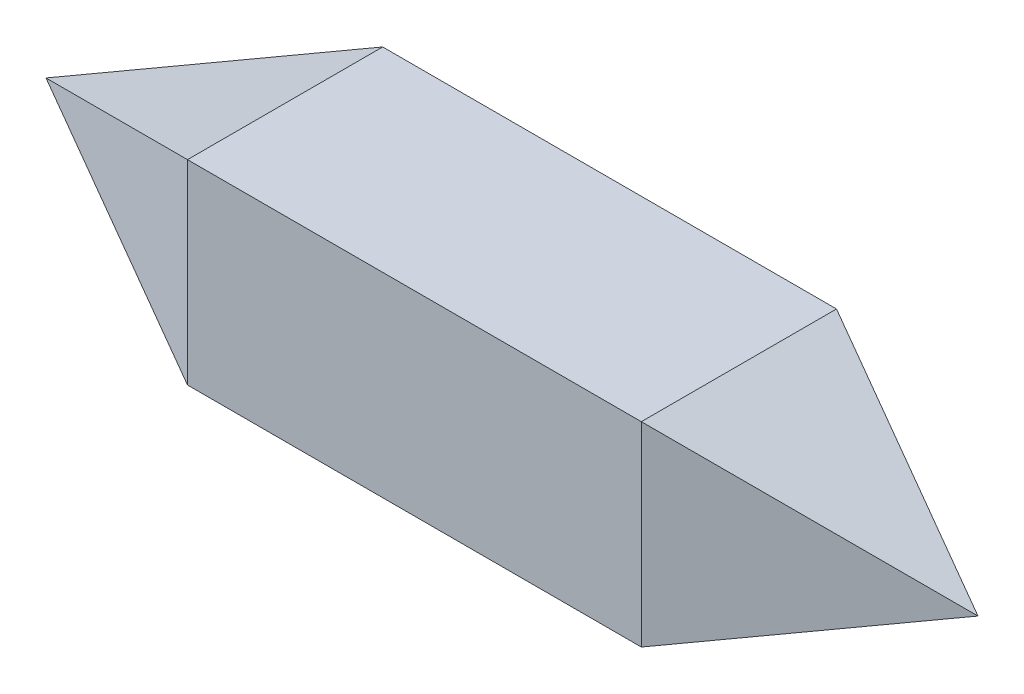
ISO-10303-21;
HEADER;
FILE_DESCRIPTION(('STEP AP214'),'2;1');
FILE_NAME('part.step','',(''),(''),'','','');
FILE_SCHEMA(('AUTOMOTIVE_DESIGN { 1 0 10303 214 1 1 1 1 }'));
ENDSEC;
DATA;
#1=APPLICATION_CONTEXT('core data for automotive mechanical design processes');
#2=APPLICATION_PROTOCOL_DEFINITION('international standard','automotive_design',2000,#1);
#3=PRODUCT_CONTEXT('',#1,'mechanical');
#4=PRODUCT('Part','Part','',(#3));
#5=PRODUCT_RELATED_PRODUCT_CATEGORY('part','',(#4));
#6=PRODUCT_DEFINITION_FORMATION('','',#4);
#7=PRODUCT_DEFINITION_CONTEXT('part definition',#1,'design');
#8=PRODUCT_DEFINITION('design','',#6,#7);
#9=PRODUCT_DEFINITION_SHAPE('','',#8);
#10=(LENGTH_UNIT() NAMED_UNIT(*) SI_UNIT(.MILLI.,.METRE.));
#11=(NAMED_UNIT(*) PLANE_ANGLE_UNIT() SI_UNIT($,.RADIAN.));
#12=(NAMED_UNIT(*) SI_UNIT($,.STERADIAN.) SOLID_ANGLE_UNIT());
#13=UNCERTAINTY_MEASURE_WITH_UNIT(LENGTH_MEASURE(1.E-05),#10,'distance_accuracy_value','');
#14=(GEOMETRIC_REPRESENTATION_CONTEXT(3) GLOBAL_UNCERTAINTY_ASSIGNED_CONTEXT((#13)) GLOBAL_UNIT_ASSIGNED_CONTEXT((#10,
#11,#12)) REPRESENTATION_CONTEXT('',''));
#15=CARTESIAN_POINT('',(0.,0.,0.));
#16=DIRECTION('',(0.,0.,1.));
#17=DIRECTION('',(1.,0.,0.));
#18=AXIS2_PLACEMENT_3D('',#15,#16,#17);
#19=CARTESIAN_POINT('',(0.,430.1,-2.5806));
#20=DIRECTION('',(-0.377937741687455,0.925831012338746,0.));
#21=DIRECTION('',(-0.925831012338746,-0.377937741687455,0.));
#22=AXIS2_PLACEMENT_3D('',#19,#20,#21);
#23=PLANE('',#22);
#24=DIRECTION('',(0.866043267642828,0.353531510985258,-0.353531511058086));
#25=VECTOR('',#24,1.);
#26=CARTESIAN_POINT('',(-526.806235776382,215.050000096685,215.049999840951));
#27=LINE('',#26,#25);
#28=CARTESIAN_POINT('',(-526.806236089617,215.049999937635,215.05));
#29=VERTEX_POINT('',#28);
#30=CARTESIAN_POINT('',(6.53239407011341E-08,430.099999933335,-1.33331054530395E-08));
#31=VERTEX_POINT('',#30);
#32=EDGE_CURVE('E87',#29,#31,#27,.T.);
#33=ORIENTED_EDGE('',*,*,#32,.F.);
#34=DIRECTION('',(-0.866043267642828,-0.353531510985259,-0.353531511058086));
#35=VECTOR('',#34,1.);
#36=CARTESIAN_POINT('',(0.,430.099999893335,430.1));
#37=LINE('',#36,#35);
#38=CARTESIAN_POINT('',(6.53237257074457E-08,430.099999933335,430.100000013333));
#39=VERTEX_POINT('',#38);
#40=EDGE_CURVE('E21',#39,#29,#37,.T.);
#41=ORIENTED_EDGE('',*,*,#40,.F.);
#42=DIRECTION('',(0.,0.,-1.));
#43=VECTOR('',#42,1.);
#44=CARTESIAN_POINT('',(0.,430.1,215.05));
#45=LINE('',#44,#43);
#46=EDGE_CURVE('E63',#39,#31,#45,.T.);
#47=ORIENTED_EDGE('',*,*,#46,.T.);
#48=EDGE_LOOP('',(#33,#41,#47));
#49=FACE_BOUND('',#48,.T.);
#50=ADVANCED_FACE('F17',(#49),#23,.T.);
#51=CARTESIAN_POINT('',(1529.967073583,213.7597,-2.5806));
#52=DIRECTION('',(0.377937741687454,0.925831012338746,0.));
#53=DIRECTION('',(-0.925831012338746,0.377937741687454,0.));
#54=AXIS2_PLACEMENT_3D('',#51,#52,#53);
#55=PLANE('',#54);
#56=DIRECTION('',(-0.866043267642828,0.353531510985258,0.353531511058086));
#57=VECTOR('',#56,1.);
#58=CARTESIAN_POINT('',(1526.80623577638,215.050000096685,215.050000159049));
#59=LINE('',#58,#57);
#60=CARTESIAN_POINT('',(1526.80623608962,215.049999937636,215.05));
#61=VERTEX_POINT('',#60);
#62=CARTESIAN_POINT('',(999.999999934676,430.099999933335,430.100000013333));
#63=VERTEX_POINT('',#62);
#64=EDGE_CURVE('E77',#61,#63,#59,.T.);
#65=ORIENTED_EDGE('',*,*,#64,.F.);
#66=DIRECTION('',(0.866043267642828,-0.353531510985258,0.353531511058086));
#67=VECTOR('',#66,1.);
#68=CARTESIAN_POINT('',(1000.,430.099999893335,0.));
#69=LINE('',#68,#67);
#70=CARTESIAN_POINT('',(999.999999934676,430.099999933335,-1.33330634956454E-08));
#71=VERTEX_POINT('',#70);
#72=EDGE_CURVE('E85',#71,#61,#69,.T.);
#73=ORIENTED_EDGE('',*,*,#72,.F.);
#74=DIRECTION('',(0.,0.,1.));
#75=VECTOR('',#74,1.);
#76=CARTESIAN_POINT('',(1000.,430.1,215.05));
#77=LINE('',#76,#75);
#78=EDGE_CURVE('E91',#71,#63,#77,.T.);
#79=ORIENTED_EDGE('',*,*,#78,.T.);
#80=EDGE_LOOP('',(#65,#73,#79));
#81=FACE_BOUND('',#80,.T.);
#82=ADVANCED_FACE('F114',(#81),#55,.T.);
#83=CARTESIAN_POINT('',(-529.967073583,-2.5806,213.7597));
#84=DIRECTION('',(-0.377937741687455,0.,0.925831012338746));
#85=DIRECTION('',(0.925831012338746,0.,0.377937741687455));
#86=AXIS2_PLACEMENT_3D('',#83,#84,#85);
#87=PLANE('',#86);
#88=ORIENTED_EDGE('',*,*,#40,.T.);
#89=DIRECTION('',(-0.866043267642828,0.353531511058086,-0.353531510985258));
#90=VECTOR('',#89,1.);
#91=CARTESIAN_POINT('',(0.,0.,430.099999893335));
#92=LINE('',#91,#90);
#93=CARTESIAN_POINT('',(6.53240118984413E-08,-1.33331054179135E-08,430.099999933335));
#94=VERTEX_POINT('',#93);
#95=EDGE_CURVE('E72',#94,#29,#92,.T.);
#96=ORIENTED_EDGE('',*,*,#95,.F.);
#97=DIRECTION('',(0.,1.,0.));
#98=VECTOR('',#97,1.);
#99=CARTESIAN_POINT('',(0.,215.05,430.1));
#100=LINE('',#99,#98);
#101=EDGE_CURVE('E74',#94,#39,#100,.T.);
#102=ORIENTED_EDGE('',*,*,#101,.T.);
#103=EDGE_LOOP('',(#88,#96,#102));
#104=FACE_BOUND('',#103,.T.);
#105=ADVANCED_FACE('F71',(#104),#87,.T.);
#106=CARTESIAN_POINT('',(1000.,-2.5806,430.1));
#107=DIRECTION('',(0.377937741687454,0.,0.925831012338746));
#108=DIRECTION('',(0.925831012338746,0.,-0.377937741687454));
#109=AXIS2_PLACEMENT_3D('',#106,#107,#108);
#110=PLANE('',#109);
#111=DIRECTION('',(-0.866043267642828,-0.353531511058086,0.353531510985258));
#112=VECTOR('',#111,1.);
#113=CARTESIAN_POINT('',(1526.80623582791,215.049999861984,215.050000075652));
#114=LINE('',#113,#112);
#115=CARTESIAN_POINT('',(999.999999934676,-1.33330915752516E-08,430.099999933335));
#116=VERTEX_POINT('',#115);
#117=EDGE_CURVE('E111',#61,#116,#114,.T.);
#118=ORIENTED_EDGE('',*,*,#117,.F.);
#119=ORIENTED_EDGE('',*,*,#64,.T.);
#120=DIRECTION('',(0.,-1.,0.));
#121=VECTOR('',#120,1.);
#122=CARTESIAN_POINT('',(1000.,215.05,430.1));
#123=LINE('',#122,#121);
#124=EDGE_CURVE('E97',#63,#116,#123,.T.);
#125=ORIENTED_EDGE('',*,*,#124,.T.);
#126=EDGE_LOOP('',(#118,#119,#125));
#127=FACE_BOUND('',#126,.T.);
#128=ADVANCED_FACE('F108',(#127),#110,.T.);
#129=CARTESIAN_POINT('',(0.,-2.5806,0.));
#130=DIRECTION('',(-0.377937741687454,0.,-0.925831012338746));
#131=DIRECTION('',(-0.925831012338746,0.,0.377937741687454));
#132=AXIS2_PLACEMENT_3D('',#129,#130,#131);
#133=PLANE('',#132);
#134=DIRECTION('',(0.866043267642828,-0.353531511058086,-0.353531510985258));
#135=VECTOR('',#134,1.);
#136=CARTESIAN_POINT('',(-526.806235827907,215.049999861984,215.049999924349));
#137=LINE('',#136,#135);
#138=CARTESIAN_POINT('',(6.53239407011341E-08,-1.33330985141455E-08,6.66654925707277E-08));
#139=VERTEX_POINT('',#138);
#140=EDGE_CURVE('E82',#29,#139,#137,.T.);
#141=ORIENTED_EDGE('',*,*,#140,.F.);
#142=ORIENTED_EDGE('',*,*,#32,.T.);
#143=DIRECTION('',(0.,1.,0.));
#144=VECTOR('',#143,1.);
#145=CARTESIAN_POINT('',(0.,215.05,0.));
#146=LINE('',#145,#144);
#147=EDGE_CURVE('E94',#139,#31,#146,.T.);
#148=ORIENTED_EDGE('',*,*,#147,.F.);
#149=EDGE_LOOP('',(#141,#142,#148));
#150=FACE_BOUND('',#149,.T.);
#151=ADVANCED_FACE('F93',(#150),#133,.T.);
#152=CARTESIAN_POINT('',(0.,430.1,430.1));
#153=DIRECTION('',(0.,-1.,0.));
#154=DIRECTION('',(0.,0.,-1.));
#155=AXIS2_PLACEMENT_3D('',#152,#153,#154);
#156=PLANE('',#155);
#157=ORIENTED_EDGE('',*,*,#46,.F.);
#158=DIRECTION('',(1.,0.,0.));
#159=VECTOR('',#158,1.);
#160=CARTESIAN_POINT('',(500.,430.1,430.1));
#161=LINE('',#160,#159);
#162=EDGE_CURVE('E95',#39,#63,#161,.T.);
#163=ORIENTED_EDGE('',*,*,#162,.T.);
#164=ORIENTED_EDGE('',*,*,#78,.F.);
#165=DIRECTION('',(1.,0.,0.));
#166=VECTOR('',#165,1.);
#167=CARTESIAN_POINT('',(500.,430.1,0.));
#168=LINE('',#167,#166);
#169=EDGE_CURVE('E147',#31,#71,#168,.T.);
#170=ORIENTED_EDGE('',*,*,#169,.F.);
#171=EDGE_LOOP('',(#157,#163,#164,#170));
#172=FACE_BOUND('',#171,.T.);
#173=ADVANCED_FACE('F121',(#172),#156,.F.);
#174=CARTESIAN_POINT('',(1529.967073583,-2.5806,216.3403));
#175=DIRECTION('',(0.377937741687454,0.,-0.925831012338746));
#176=DIRECTION('',(-0.925831012338746,0.,-0.377937741687454));
#177=AXIS2_PLACEMENT_3D('',#174,#175,#176);
#178=PLANE('',#177);
#179=ORIENTED_EDGE('',*,*,#72,.T.);
#180=DIRECTION('',(0.866043267642828,0.353531511058086,0.353531510985258));
#181=VECTOR('',#180,1.);
#182=CARTESIAN_POINT('',(1000.,0.,1.0666480068991E-07));
#183=LINE('',#182,#181);
#184=CARTESIAN_POINT('',(999.999999934676,-1.33331054179135E-08,6.66655127747607E-08));
#185=VERTEX_POINT('',#184);
#186=EDGE_CURVE('E100',#185,#61,#183,.T.);
#187=ORIENTED_EDGE('',*,*,#186,.F.);
#188=DIRECTION('',(0.,-1.,0.));
#189=VECTOR('',#188,1.);
#190=CARTESIAN_POINT('',(1000.,215.05,0.));
#191=LINE('',#190,#189);
#192=EDGE_CURVE('E35',#71,#185,#191,.T.);
#193=ORIENTED_EDGE('',*,*,#192,.F.);
#194=EDGE_LOOP('',(#179,#187,#193));
#195=FACE_BOUND('',#194,.T.);
#196=ADVANCED_FACE('F123',(#195),#178,.T.);
#197=CARTESIAN_POINT('',(-529.967073583,216.3403,-2.5806));
#198=DIRECTION('',(-0.377937741687454,-0.925831012338746,0.));
#199=DIRECTION('',(0.925831012338746,-0.377937741687454,0.));
#200=AXIS2_PLACEMENT_3D('',#197,#198,#199);
#201=PLANE('',#200);
#202=ORIENTED_EDGE('',*,*,#95,.T.);
#203=ORIENTED_EDGE('',*,*,#140,.T.);
#204=DIRECTION('',(0.,0.,1.));
#205=VECTOR('',#204,1.);
#206=CARTESIAN_POINT('',(0.,0.,215.05));
#207=LINE('',#206,#205);
#208=EDGE_CURVE('E84',#139,#94,#207,.T.);
#209=ORIENTED_EDGE('',*,*,#208,.T.);
#210=EDGE_LOOP('',(#202,#203,#209));
#211=FACE_BOUND('',#210,.T.);
#212=ADVANCED_FACE('F80',(#211),#201,.T.);
#213=CARTESIAN_POINT('',(1000.,0.,430.1));
#214=DIRECTION('',(0.,0.,-1.));
#215=DIRECTION('',(-1.,0.,0.));
#216=AXIS2_PLACEMENT_3D('',#213,#214,#215);
#217=PLANE('',#216);
#218=DIRECTION('',(1.,0.,0.));
#219=VECTOR('',#218,1.);
#220=CARTESIAN_POINT('',(500.,0.,430.1));
#221=LINE('',#220,#219);
#222=EDGE_CURVE('E119',#94,#116,#221,.T.);
#223=ORIENTED_EDGE('',*,*,#222,.T.);
#224=ORIENTED_EDGE('',*,*,#124,.F.);
#225=ORIENTED_EDGE('',*,*,#162,.F.);
#226=ORIENTED_EDGE('',*,*,#101,.F.);
#227=EDGE_LOOP('',(#223,#224,#225,#226));
#228=FACE_BOUND('',#227,.T.);
#229=ADVANCED_FACE('F118',(#228),#217,.F.);
#230=CARTESIAN_POINT('',(1000.,0.,-2.5806));
#231=DIRECTION('',(0.377937741687454,-0.925831012338746,0.));
#232=DIRECTION('',(0.925831012338746,0.377937741687454,0.));
#233=AXIS2_PLACEMENT_3D('',#230,#231,#232);
#234=PLANE('',#233);
#235=ORIENTED_EDGE('',*,*,#186,.T.);
#236=ORIENTED_EDGE('',*,*,#117,.T.);
#237=DIRECTION('',(0.,0.,-1.));
#238=VECTOR('',#237,1.);
#239=CARTESIAN_POINT('',(1000.,0.,215.05));
#240=LINE('',#239,#238);
#241=EDGE_CURVE('E27',#116,#185,#240,.T.);
#242=ORIENTED_EDGE('',*,*,#241,.T.);
#243=EDGE_LOOP('',(#235,#236,#242));
#244=FACE_BOUND('',#243,.T.);
#245=ADVANCED_FACE('F139',(#244),#234,.T.);
#246=CARTESIAN_POINT('',(1000.,0.,0.));
#247=DIRECTION('',(0.,0.,-1.));
#248=DIRECTION('',(-1.,0.,0.));
#249=AXIS2_PLACEMENT_3D('',#246,#247,#248);
#250=PLANE('',#249);
#251=ORIENTED_EDGE('',*,*,#192,.T.);
#252=DIRECTION('',(-1.,0.,0.));
#253=VECTOR('',#252,1.);
#254=CARTESIAN_POINT('',(500.,0.,0.));
#255=LINE('',#254,#253);
#256=EDGE_CURVE('E11',#185,#139,#255,.T.);
#257=ORIENTED_EDGE('',*,*,#256,.T.);
#258=ORIENTED_EDGE('',*,*,#147,.T.);
#259=ORIENTED_EDGE('',*,*,#169,.T.);
#260=EDGE_LOOP('',(#251,#257,#258,#259));
#261=FACE_BOUND('',#260,.T.);
#262=ADVANCED_FACE('F134',(#261),#250,.T.);
#263=CARTESIAN_POINT('',(0.,0.,0.));
#264=DIRECTION('',(0.,1.,0.));
#265=DIRECTION('',(0.,0.,1.));
#266=AXIS2_PLACEMENT_3D('',#263,#264,#265);
#267=PLANE('',#266);
#268=ORIENTED_EDGE('',*,*,#241,.F.);
#269=ORIENTED_EDGE('',*,*,#222,.F.);
#270=ORIENTED_EDGE('',*,*,#208,.F.);
#271=ORIENTED_EDGE('',*,*,#256,.F.);
#272=EDGE_LOOP('',(#268,#269,#270,#271));
#273=FACE_BOUND('',#272,.T.);
#274=ADVANCED_FACE('F19',(#273),#267,.F.);
#275=CLOSED_SHELL('',(#50,#82,#105,#128,#151,#173,#196,#212,#229,#245,#262,#274));
#276=MANIFOLD_SOLID_BREP('B1',#275);
#277=ADVANCED_BREP_SHAPE_REPRESENTATION('',(#18,#276),#14);
#278=SHAPE_DEFINITION_REPRESENTATION(#9,#277);
ENDSEC;
END-ISO-10303-21;
